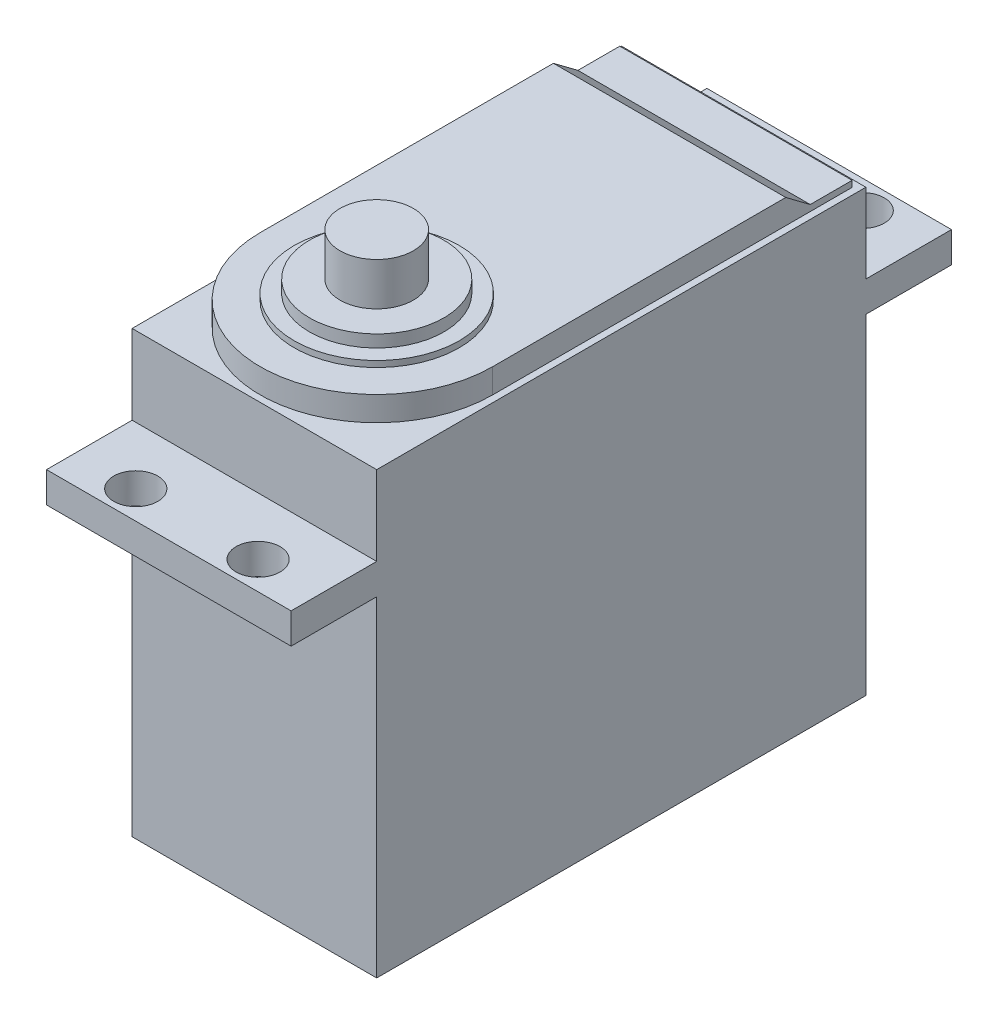
ISO-10303-21;
HEADER;
FILE_DESCRIPTION(('STEP AP214'),'2;1');
FILE_NAME('part.step','',(''),(''),'','','');
FILE_SCHEMA(('AUTOMOTIVE_DESIGN { 1 0 10303 214 1 1 1 1 }'));
ENDSEC;
DATA;
#1=APPLICATION_CONTEXT('core data for automotive mechanical design processes');
#2=APPLICATION_PROTOCOL_DEFINITION('international standard','automotive_design',2000,#1);
#3=PRODUCT_CONTEXT('',#1,'mechanical');
#4=PRODUCT('Part','Part','',(#3));
#5=PRODUCT_RELATED_PRODUCT_CATEGORY('part','',(#4));
#6=PRODUCT_DEFINITION_FORMATION('','',#4);
#7=PRODUCT_DEFINITION_CONTEXT('part definition',#1,'design');
#8=PRODUCT_DEFINITION('design','',#6,#7);
#9=PRODUCT_DEFINITION_SHAPE('','',#8);
#10=(LENGTH_UNIT() NAMED_UNIT(*) SI_UNIT(.MILLI.,.METRE.));
#11=(NAMED_UNIT(*) PLANE_ANGLE_UNIT() SI_UNIT($,.RADIAN.));
#12=(NAMED_UNIT(*) SI_UNIT($,.STERADIAN.) SOLID_ANGLE_UNIT());
#13=UNCERTAINTY_MEASURE_WITH_UNIT(LENGTH_MEASURE(1.E-05),#10,'distance_accuracy_value','');
#14=(GEOMETRIC_REPRESENTATION_CONTEXT(3) GLOBAL_UNCERTAINTY_ASSIGNED_CONTEXT((#13)) GLOBAL_UNIT_ASSIGNED_CONTEXT((#10,
#11,#12)) REPRESENTATION_CONTEXT('',''));
#15=CARTESIAN_POINT('',(0.,0.,0.));
#16=DIRECTION('',(0.,0.,1.));
#17=DIRECTION('',(1.,0.,0.));
#18=AXIS2_PLACEMENT_3D('',#15,#16,#17);
#19=CARTESIAN_POINT('',(0.,0.,40.));
#20=DIRECTION('',(0.,0.,-1.));
#21=DIRECTION('',(-1.,0.,0.));
#22=AXIS2_PLACEMENT_3D('',#19,#20,#21);
#23=PLANE('',#22);
#24=DIRECTION('',(0.,1.,0.));
#25=VECTOR('',#24,1.);
#26=CARTESIAN_POINT('',(20.,0.,40.));
#27=LINE('',#26,#25);
#28=CARTESIAN_POINT('',(20.,29.5,40.));
#29=VERTEX_POINT('',#28);
#30=CARTESIAN_POINT('',(20.,36.,40.));
#31=VERTEX_POINT('',#30);
#32=EDGE_CURVE('E296',#29,#31,#27,.T.);
#33=ORIENTED_EDGE('',*,*,#32,.T.);
#34=DIRECTION('',(1.,0.,0.));
#35=VECTOR('',#34,1.);
#36=CARTESIAN_POINT('',(20.,36.,40.));
#37=LINE('',#36,#35);
#38=CARTESIAN_POINT('',(0.,36.,40.));
#39=VERTEX_POINT('',#38);
#40=EDGE_CURVE('E53',#39,#31,#37,.T.);
#41=ORIENTED_EDGE('',*,*,#40,.F.);
#42=DIRECTION('',(0.,-1.,0.));
#43=VECTOR('',#42,1.);
#44=CARTESIAN_POINT('',(0.,0.,40.));
#45=LINE('',#44,#43);
#46=CARTESIAN_POINT('',(0.,29.5,40.));
#47=VERTEX_POINT('',#46);
#48=EDGE_CURVE('E291',#39,#47,#45,.T.);
#49=ORIENTED_EDGE('',*,*,#48,.T.);
#50=DIRECTION('',(-1.,0.,0.));
#51=VECTOR('',#50,1.);
#52=CARTESIAN_POINT('',(27.4330343736593,29.5,40.));
#53=LINE('',#52,#51);
#54=EDGE_CURVE('E243',#29,#47,#53,.T.);
#55=ORIENTED_EDGE('',*,*,#54,.F.);
#56=EDGE_LOOP('',(#33,#41,#49,#55));
#57=FACE_BOUND('',#56,.T.);
#58=ADVANCED_FACE('F38',(#57),#23,.F.);
#59=CARTESIAN_POINT('',(0.,0.,0.));
#60=DIRECTION('',(0.,0.,-1.));
#61=DIRECTION('',(-1.,0.,0.));
#62=AXIS2_PLACEMENT_3D('',#59,#60,#61);
#63=PLANE('',#62);
#64=DIRECTION('',(-1.,0.,0.));
#65=VECTOR('',#64,1.);
#66=CARTESIAN_POINT('',(0.,36.,0.));
#67=LINE('',#66,#65);
#68=CARTESIAN_POINT('',(20.,36.,0.));
#69=VERTEX_POINT('',#68);
#70=CARTESIAN_POINT('',(0.,36.,0.));
#71=VERTEX_POINT('',#70);
#72=EDGE_CURVE('E208',#69,#71,#67,.T.);
#73=ORIENTED_EDGE('',*,*,#72,.F.);
#74=DIRECTION('',(0.,1.,0.));
#75=VECTOR('',#74,1.);
#76=CARTESIAN_POINT('',(20.,0.,0.));
#77=LINE('',#76,#75);
#78=CARTESIAN_POINT('',(20.,29.5,0.));
#79=VERTEX_POINT('',#78);
#80=EDGE_CURVE('E304',#79,#69,#77,.T.);
#81=ORIENTED_EDGE('',*,*,#80,.F.);
#82=DIRECTION('',(-1.,0.,0.));
#83=VECTOR('',#82,1.);
#84=CARTESIAN_POINT('',(27.4330343736593,29.5,0.));
#85=LINE('',#84,#83);
#86=CARTESIAN_POINT('',(0.,29.5,0.));
#87=VERTEX_POINT('',#86);
#88=EDGE_CURVE('E279',#79,#87,#85,.T.);
#89=ORIENTED_EDGE('',*,*,#88,.T.);
#90=DIRECTION('',(0.,-1.,0.));
#91=VECTOR('',#90,1.);
#92=CARTESIAN_POINT('',(0.,0.,0.));
#93=LINE('',#92,#91);
#94=EDGE_CURVE('E300',#71,#87,#93,.T.);
#95=ORIENTED_EDGE('',*,*,#94,.F.);
#96=EDGE_LOOP('',(#73,#81,#89,#95));
#97=FACE_BOUND('',#96,.T.);
#98=ADVANCED_FACE('F349',(#97),#63,.T.);
#99=CARTESIAN_POINT('',(0.,0.,40.));
#100=DIRECTION('',(1.,0.,0.));
#101=DIRECTION('',(0.,0.,-1.));
#102=AXIS2_PLACEMENT_3D('',#99,#100,#101);
#103=PLANE('',#102);
#104=ORIENTED_EDGE('',*,*,#48,.F.);
#105=DIRECTION('',(0.,0.,1.));
#106=VECTOR('',#105,1.);
#107=CARTESIAN_POINT('',(0.,36.,40.));
#108=LINE('',#107,#106);
#109=EDGE_CURVE('E210',#71,#39,#108,.T.);
#110=ORIENTED_EDGE('',*,*,#109,.F.);
#111=ORIENTED_EDGE('',*,*,#94,.T.);
#112=DIRECTION('',(0.,0.,-1.));
#113=VECTOR('',#112,1.);
#114=CARTESIAN_POINT('',(0.,29.5,0.));
#115=LINE('',#114,#113);
#116=CARTESIAN_POINT('',(0.,29.5,-7.));
#117=VERTEX_POINT('',#116);
#118=EDGE_CURVE('E264',#87,#117,#115,.T.);
#119=ORIENTED_EDGE('',*,*,#118,.T.);
#120=DIRECTION('',(0.,-1.,0.));
#121=VECTOR('',#120,1.);
#122=CARTESIAN_POINT('',(0.,29.5,-7.));
#123=LINE('',#122,#121);
#124=CARTESIAN_POINT('',(0.,27.,-7.));
#125=VERTEX_POINT('',#124);
#126=EDGE_CURVE('E273',#117,#125,#123,.T.);
#127=ORIENTED_EDGE('',*,*,#126,.T.);
#128=DIRECTION('',(0.,0.,1.));
#129=VECTOR('',#128,1.);
#130=CARTESIAN_POINT('',(0.,27.,0.));
#131=LINE('',#130,#129);
#132=CARTESIAN_POINT('',(0.,27.,0.));
#133=VERTEX_POINT('',#132);
#134=EDGE_CURVE('E276',#125,#133,#131,.T.);
#135=ORIENTED_EDGE('',*,*,#134,.T.);
#136=CARTESIAN_POINT('',(0.,0.,0.));
#137=VERTEX_POINT('',#136);
#138=EDGE_CURVE('E290',#133,#137,#93,.T.);
#139=ORIENTED_EDGE('',*,*,#138,.T.);
#140=DIRECTION('',(0.,0.,-1.));
#141=VECTOR('',#140,1.);
#142=CARTESIAN_POINT('',(0.,0.,40.));
#143=LINE('',#142,#141);
#144=CARTESIAN_POINT('',(0.,0.,40.));
#145=VERTEX_POINT('',#144);
#146=EDGE_CURVE('E310',#145,#137,#143,.T.);
#147=ORIENTED_EDGE('',*,*,#146,.F.);
#148=CARTESIAN_POINT('',(0.,27.,40.));
#149=VERTEX_POINT('',#148);
#150=EDGE_CURVE('E294',#149,#145,#45,.T.);
#151=ORIENTED_EDGE('',*,*,#150,.F.);
#152=DIRECTION('',(0.,0.,1.));
#153=VECTOR('',#152,1.);
#154=CARTESIAN_POINT('',(0.,27.,40.));
#155=LINE('',#154,#153);
#156=CARTESIAN_POINT('',(0.,27.,47.));
#157=VERTEX_POINT('',#156);
#158=EDGE_CURVE('E239',#149,#157,#155,.T.);
#159=ORIENTED_EDGE('',*,*,#158,.T.);
#160=DIRECTION('',(0.,1.,0.));
#161=VECTOR('',#160,1.);
#162=CARTESIAN_POINT('',(0.,29.5,47.));
#163=LINE('',#162,#161);
#164=CARTESIAN_POINT('',(0.,29.5,47.));
#165=VERTEX_POINT('',#164);
#166=EDGE_CURVE('E248',#157,#165,#163,.T.);
#167=ORIENTED_EDGE('',*,*,#166,.T.);
#168=DIRECTION('',(0.,0.,-1.));
#169=VECTOR('',#168,1.);
#170=CARTESIAN_POINT('',(0.,29.5,40.));
#171=LINE('',#170,#169);
#172=EDGE_CURVE('E251',#165,#47,#171,.T.);
#173=ORIENTED_EDGE('',*,*,#172,.T.);
#174=EDGE_LOOP('',(#104,#110,#111,#119,#127,#135,#139,#147,#151,#159,#167,#173));
#175=FACE_BOUND('',#174,.T.);
#176=ADVANCED_FACE('F40',(#175),#103,.F.);
#177=CARTESIAN_POINT('',(0.,0.,40.));
#178=DIRECTION('',(0.,1.,0.));
#179=DIRECTION('',(0.,0.,1.));
#180=AXIS2_PLACEMENT_3D('',#177,#178,#179);
#181=PLANE('',#180);
#182=DIRECTION('',(1.,0.,0.));
#183=VECTOR('',#182,1.);
#184=CARTESIAN_POINT('',(0.,0.,0.));
#185=LINE('',#184,#183);
#186=CARTESIAN_POINT('',(20.,0.,0.));
#187=VERTEX_POINT('',#186);
#188=EDGE_CURVE('E302',#137,#187,#185,.T.);
#189=ORIENTED_EDGE('',*,*,#188,.T.);
#190=DIRECTION('',(0.,0.,-1.));
#191=VECTOR('',#190,1.);
#192=CARTESIAN_POINT('',(20.,0.,40.));
#193=LINE('',#192,#191);
#194=CARTESIAN_POINT('',(20.,0.,40.));
#195=VERTEX_POINT('',#194);
#196=EDGE_CURVE('E299',#195,#187,#193,.T.);
#197=ORIENTED_EDGE('',*,*,#196,.F.);
#198=DIRECTION('',(1.,0.,0.));
#199=VECTOR('',#198,1.);
#200=CARTESIAN_POINT('',(0.,0.,40.));
#201=LINE('',#200,#199);
#202=EDGE_CURVE('E293',#145,#195,#201,.T.);
#203=ORIENTED_EDGE('',*,*,#202,.F.);
#204=ORIENTED_EDGE('',*,*,#146,.T.);
#205=EDGE_LOOP('',(#189,#197,#203,#204));
#206=FACE_BOUND('',#205,.T.);
#207=ADVANCED_FACE('F370',(#206),#181,.F.);
#208=CARTESIAN_POINT('',(20.,0.,40.));
#209=DIRECTION('',(-1.,0.,0.));
#210=DIRECTION('',(0.,0.,1.));
#211=AXIS2_PLACEMENT_3D('',#208,#209,#210);
#212=PLANE('',#211);
#213=ORIENTED_EDGE('',*,*,#80,.T.);
#214=DIRECTION('',(0.,0.,-1.));
#215=VECTOR('',#214,1.);
#216=CARTESIAN_POINT('',(20.,36.,0.));
#217=LINE('',#216,#215);
#218=EDGE_CURVE('E202',#31,#69,#217,.T.);
#219=ORIENTED_EDGE('',*,*,#218,.F.);
#220=ORIENTED_EDGE('',*,*,#32,.F.);
#221=DIRECTION('',(0.,0.,1.));
#222=VECTOR('',#221,1.);
#223=CARTESIAN_POINT('',(20.,29.5,40.));
#224=LINE('',#223,#222);
#225=CARTESIAN_POINT('',(20.,29.5,47.));
#226=VERTEX_POINT('',#225);
#227=EDGE_CURVE('E242',#29,#226,#224,.T.);
#228=ORIENTED_EDGE('',*,*,#227,.T.);
#229=DIRECTION('',(0.,-1.,0.));
#230=VECTOR('',#229,1.);
#231=CARTESIAN_POINT('',(20.,29.5,47.));
#232=LINE('',#231,#230);
#233=CARTESIAN_POINT('',(20.,27.,47.));
#234=VERTEX_POINT('',#233);
#235=EDGE_CURVE('E240',#226,#234,#232,.T.);
#236=ORIENTED_EDGE('',*,*,#235,.T.);
#237=DIRECTION('',(0.,0.,-1.));
#238=VECTOR('',#237,1.);
#239=CARTESIAN_POINT('',(20.,27.,40.));
#240=LINE('',#239,#238);
#241=CARTESIAN_POINT('',(20.,27.,40.));
#242=VERTEX_POINT('',#241);
#243=EDGE_CURVE('E245',#234,#242,#240,.T.);
#244=ORIENTED_EDGE('',*,*,#243,.T.);
#245=EDGE_CURVE('E297',#195,#242,#27,.T.);
#246=ORIENTED_EDGE('',*,*,#245,.F.);
#247=ORIENTED_EDGE('',*,*,#196,.T.);
#248=CARTESIAN_POINT('',(20.,27.,0.));
#249=VERTEX_POINT('',#248);
#250=EDGE_CURVE('E305',#187,#249,#77,.T.);
#251=ORIENTED_EDGE('',*,*,#250,.T.);
#252=DIRECTION('',(0.,0.,-1.));
#253=VECTOR('',#252,1.);
#254=CARTESIAN_POINT('',(20.,27.,0.));
#255=LINE('',#254,#253);
#256=CARTESIAN_POINT('',(20.,27.,-7.));
#257=VERTEX_POINT('',#256);
#258=EDGE_CURVE('E267',#249,#257,#255,.T.);
#259=ORIENTED_EDGE('',*,*,#258,.T.);
#260=DIRECTION('',(0.,1.,0.));
#261=VECTOR('',#260,1.);
#262=CARTESIAN_POINT('',(20.,29.5,-7.));
#263=LINE('',#262,#261);
#264=CARTESIAN_POINT('',(20.,29.5,-7.));
#265=VERTEX_POINT('',#264);
#266=EDGE_CURVE('E265',#257,#265,#263,.T.);
#267=ORIENTED_EDGE('',*,*,#266,.T.);
#268=DIRECTION('',(0.,0.,1.));
#269=VECTOR('',#268,1.);
#270=CARTESIAN_POINT('',(20.,29.5,0.));
#271=LINE('',#270,#269);
#272=EDGE_CURVE('E270',#265,#79,#271,.T.);
#273=ORIENTED_EDGE('',*,*,#272,.T.);
#274=EDGE_LOOP('',(#213,#219,#220,#228,#236,#244,#246,#247,#251,#259,#267,#273));
#275=FACE_BOUND('',#274,.T.);
#276=ADVANCED_FACE('F362',(#275),#212,.F.);
#277=ORIENTED_EDGE('',*,*,#245,.T.);
#278=DIRECTION('',(-1.,0.,0.));
#279=VECTOR('',#278,1.);
#280=CARTESIAN_POINT('',(27.4330343736593,27.,40.));
#281=LINE('',#280,#279);
#282=EDGE_CURVE('E254',#242,#149,#281,.T.);
#283=ORIENTED_EDGE('',*,*,#282,.T.);
#284=ORIENTED_EDGE('',*,*,#150,.T.);
#285=ORIENTED_EDGE('',*,*,#202,.T.);
#286=EDGE_LOOP('',(#277,#283,#284,#285));
#287=FACE_BOUND('',#286,.T.);
#288=ADVANCED_FACE('F352',(#287),#23,.F.);
#289=DIRECTION('',(-1.,0.,0.));
#290=VECTOR('',#289,1.);
#291=CARTESIAN_POINT('',(27.4330343736593,27.,0.));
#292=LINE('',#291,#290);
#293=EDGE_CURVE('E268',#249,#133,#292,.T.);
#294=ORIENTED_EDGE('',*,*,#293,.F.);
#295=ORIENTED_EDGE('',*,*,#250,.F.);
#296=ORIENTED_EDGE('',*,*,#188,.F.);
#297=ORIENTED_EDGE('',*,*,#138,.F.);
#298=EDGE_LOOP('',(#294,#295,#296,#297));
#299=FACE_BOUND('',#298,.T.);
#300=ADVANCED_FACE('F358',(#299),#63,.T.);
#301=CARTESIAN_POINT('',(27.4330343736593,27.,0.));
#302=DIRECTION('',(0.,-1.,0.));
#303=DIRECTION('',(0.,0.,-1.));
#304=AXIS2_PLACEMENT_3D('',#301,#302,#303);
#305=PLANE('',#304);
#306=CARTESIAN_POINT('',(15.,27.,-4.7));
#307=DIRECTION('',(0.,-1.,0.));
#308=DIRECTION('',(0.,0.,-1.));
#309=AXIS2_PLACEMENT_3D('',#306,#307,#308);
#310=CIRCLE('',#309,1.80000000000001);
#311=CARTESIAN_POINT('',(15.,27.,-6.50000000000001));
#312=VERTEX_POINT('',#311);
#313=EDGE_CURVE('E232',#312,#312,#310,.T.);
#314=ORIENTED_EDGE('',*,*,#313,.F.);
#315=EDGE_LOOP('',(#314));
#316=FACE_BOUND('',#315,.T.);
#317=CARTESIAN_POINT('',(5.,27.,-4.7));
#318=DIRECTION('',(0.,-1.,0.));
#319=DIRECTION('',(0.,0.,-1.));
#320=AXIS2_PLACEMENT_3D('',#317,#318,#319);
#321=CIRCLE('',#320,1.80000000000001);
#322=CARTESIAN_POINT('',(5.,27.,-6.50000000000001));
#323=VERTEX_POINT('',#322);
#324=EDGE_CURVE('E229',#323,#323,#321,.T.);
#325=ORIENTED_EDGE('',*,*,#324,.F.);
#326=EDGE_LOOP('',(#325));
#327=FACE_BOUND('',#326,.T.);
#328=ORIENTED_EDGE('',*,*,#258,.F.);
#329=ORIENTED_EDGE('',*,*,#293,.T.);
#330=ORIENTED_EDGE('',*,*,#134,.F.);
#331=DIRECTION('',(-1.,0.,0.));
#332=VECTOR('',#331,1.);
#333=CARTESIAN_POINT('',(27.4330343736593,27.,-7.));
#334=LINE('',#333,#332);
#335=EDGE_CURVE('E282',#257,#125,#334,.T.);
#336=ORIENTED_EDGE('',*,*,#335,.F.);
#337=EDGE_LOOP('',(#328,#329,#330,#336));
#338=FACE_BOUND('',#337,.T.);
#339=ADVANCED_FACE('F368',(#316,#327,#338),#305,.T.);
#340=CARTESIAN_POINT('',(27.4330343736593,29.5,-7.));
#341=DIRECTION('',(0.,0.,-1.));
#342=DIRECTION('',(-1.,0.,0.));
#343=AXIS2_PLACEMENT_3D('',#340,#341,#342);
#344=PLANE('',#343);
#345=ORIENTED_EDGE('',*,*,#266,.F.);
#346=ORIENTED_EDGE('',*,*,#335,.T.);
#347=ORIENTED_EDGE('',*,*,#126,.F.);
#348=DIRECTION('',(-1.,0.,0.));
#349=VECTOR('',#348,1.);
#350=CARTESIAN_POINT('',(27.4330343736593,29.5,-7.));
#351=LINE('',#350,#349);
#352=EDGE_CURVE('E284',#265,#117,#351,.T.);
#353=ORIENTED_EDGE('',*,*,#352,.F.);
#354=EDGE_LOOP('',(#345,#346,#347,#353));
#355=FACE_BOUND('',#354,.T.);
#356=ADVANCED_FACE('F402',(#355),#344,.T.);
#357=CARTESIAN_POINT('',(27.4330343736593,29.5,0.));
#358=DIRECTION('',(0.,1.,0.));
#359=DIRECTION('',(0.,0.,1.));
#360=AXIS2_PLACEMENT_3D('',#357,#358,#359);
#361=PLANE('',#360);
#362=CARTESIAN_POINT('',(15.,29.5,-4.7));
#363=DIRECTION('',(0.,1.,0.));
#364=DIRECTION('',(0.,0.,1.));
#365=AXIS2_PLACEMENT_3D('',#362,#363,#364);
#366=CIRCLE('',#365,1.80000000000001);
#367=CARTESIAN_POINT('',(15.,29.5,-2.89999999999999));
#368=VERTEX_POINT('',#367);
#369=EDGE_CURVE('E219',#368,#368,#366,.T.);
#370=ORIENTED_EDGE('',*,*,#369,.F.);
#371=EDGE_LOOP('',(#370));
#372=FACE_BOUND('',#371,.T.);
#373=CARTESIAN_POINT('',(5.,29.5,-4.7));
#374=DIRECTION('',(0.,1.,0.));
#375=DIRECTION('',(0.,0.,1.));
#376=AXIS2_PLACEMENT_3D('',#373,#374,#375);
#377=CIRCLE('',#376,1.80000000000001);
#378=CARTESIAN_POINT('',(5.,29.5,-2.89999999999999));
#379=VERTEX_POINT('',#378);
#380=EDGE_CURVE('E216',#379,#379,#377,.T.);
#381=ORIENTED_EDGE('',*,*,#380,.F.);
#382=EDGE_LOOP('',(#381));
#383=FACE_BOUND('',#382,.T.);
#384=ORIENTED_EDGE('',*,*,#272,.F.);
#385=ORIENTED_EDGE('',*,*,#352,.T.);
#386=ORIENTED_EDGE('',*,*,#118,.F.);
#387=ORIENTED_EDGE('',*,*,#88,.F.);
#388=EDGE_LOOP('',(#384,#385,#386,#387));
#389=FACE_BOUND('',#388,.T.);
#390=ADVANCED_FACE('F406',(#372,#383,#389),#361,.T.);
#391=CARTESIAN_POINT('',(27.4330343736593,29.5,40.));
#392=DIRECTION('',(0.,1.,0.));
#393=DIRECTION('',(0.,0.,1.));
#394=AXIS2_PLACEMENT_3D('',#391,#392,#393);
#395=PLANE('',#394);
#396=CARTESIAN_POINT('',(5.,29.5,44.7));
#397=DIRECTION('',(0.,1.,0.));
#398=DIRECTION('',(0.,0.,1.));
#399=AXIS2_PLACEMENT_3D('',#396,#397,#398);
#400=CIRCLE('',#399,1.80000000000001);
#401=CARTESIAN_POINT('',(5.,29.5,46.5));
#402=VERTEX_POINT('',#401);
#403=EDGE_CURVE('E220',#402,#402,#400,.T.);
#404=ORIENTED_EDGE('',*,*,#403,.F.);
#405=EDGE_LOOP('',(#404));
#406=FACE_BOUND('',#405,.T.);
#407=CARTESIAN_POINT('',(15.,29.5,44.7));
#408=DIRECTION('',(0.,1.,0.));
#409=DIRECTION('',(0.,0.,1.));
#410=AXIS2_PLACEMENT_3D('',#407,#408,#409);
#411=CIRCLE('',#410,1.80000000000001);
#412=CARTESIAN_POINT('',(15.,29.5,46.5));
#413=VERTEX_POINT('',#412);
#414=EDGE_CURVE('E223',#413,#413,#411,.T.);
#415=ORIENTED_EDGE('',*,*,#414,.F.);
#416=EDGE_LOOP('',(#415));
#417=FACE_BOUND('',#416,.T.);
#418=ORIENTED_EDGE('',*,*,#227,.F.);
#419=ORIENTED_EDGE('',*,*,#54,.T.);
#420=ORIENTED_EDGE('',*,*,#172,.F.);
#421=DIRECTION('',(-1.,0.,0.));
#422=VECTOR('',#421,1.);
#423=CARTESIAN_POINT('',(27.4330343736593,29.5,47.));
#424=LINE('',#423,#422);
#425=EDGE_CURVE('E257',#226,#165,#424,.T.);
#426=ORIENTED_EDGE('',*,*,#425,.F.);
#427=EDGE_LOOP('',(#418,#419,#420,#426));
#428=FACE_BOUND('',#427,.T.);
#429=ADVANCED_FACE('F413',(#406,#417,#428),#395,.T.);
#430=CARTESIAN_POINT('',(27.4330343736593,29.5,47.));
#431=DIRECTION('',(0.,0.,1.));
#432=DIRECTION('',(1.,0.,0.));
#433=AXIS2_PLACEMENT_3D('',#430,#431,#432);
#434=PLANE('',#433);
#435=ORIENTED_EDGE('',*,*,#235,.F.);
#436=ORIENTED_EDGE('',*,*,#425,.T.);
#437=ORIENTED_EDGE('',*,*,#166,.F.);
#438=DIRECTION('',(-1.,0.,0.));
#439=VECTOR('',#438,1.);
#440=CARTESIAN_POINT('',(27.4330343736593,27.,47.));
#441=LINE('',#440,#439);
#442=EDGE_CURVE('E259',#234,#157,#441,.T.);
#443=ORIENTED_EDGE('',*,*,#442,.F.);
#444=EDGE_LOOP('',(#435,#436,#437,#443));
#445=FACE_BOUND('',#444,.T.);
#446=ADVANCED_FACE('F416',(#445),#434,.T.);
#447=CARTESIAN_POINT('',(27.4330343736593,27.,40.));
#448=DIRECTION('',(0.,-1.,0.));
#449=DIRECTION('',(0.,0.,-1.));
#450=AXIS2_PLACEMENT_3D('',#447,#448,#449);
#451=PLANE('',#450);
#452=CARTESIAN_POINT('',(5.,27.,44.7));
#453=DIRECTION('',(0.,-1.,0.));
#454=DIRECTION('',(0.,0.,-1.));
#455=AXIS2_PLACEMENT_3D('',#452,#453,#454);
#456=CIRCLE('',#455,1.80000000000001);
#457=CARTESIAN_POINT('',(5.,27.,42.9));
#458=VERTEX_POINT('',#457);
#459=EDGE_CURVE('E233',#458,#458,#456,.T.);
#460=ORIENTED_EDGE('',*,*,#459,.F.);
#461=EDGE_LOOP('',(#460));
#462=FACE_BOUND('',#461,.T.);
#463=CARTESIAN_POINT('',(15.,27.,44.7));
#464=DIRECTION('',(0.,-1.,0.));
#465=DIRECTION('',(0.,0.,-1.));
#466=AXIS2_PLACEMENT_3D('',#463,#464,#465);
#467=CIRCLE('',#466,1.80000000000001);
#468=CARTESIAN_POINT('',(15.,27.,42.9));
#469=VERTEX_POINT('',#468);
#470=EDGE_CURVE('E228',#469,#469,#467,.T.);
#471=ORIENTED_EDGE('',*,*,#470,.F.);
#472=EDGE_LOOP('',(#471));
#473=FACE_BOUND('',#472,.T.);
#474=ORIENTED_EDGE('',*,*,#243,.F.);
#475=ORIENTED_EDGE('',*,*,#442,.T.);
#476=ORIENTED_EDGE('',*,*,#158,.F.);
#477=ORIENTED_EDGE('',*,*,#282,.F.);
#478=EDGE_LOOP('',(#474,#475,#476,#477));
#479=FACE_BOUND('',#478,.T.);
#480=ADVANCED_FACE('F384',(#462,#473,#479),#451,.T.);
#481=CARTESIAN_POINT('',(15.,19.5,44.7));
#482=DIRECTION('',(0.,1.,0.));
#483=DIRECTION('',(0.,0.,1.));
#484=AXIS2_PLACEMENT_3D('',#481,#482,#483);
#485=CYLINDRICAL_SURFACE('',#484,1.80000000000001);
#486=ORIENTED_EDGE('',*,*,#470,.T.);
#487=EDGE_LOOP('',(#486));
#488=FACE_BOUND('',#487,.T.);
#489=ORIENTED_EDGE('',*,*,#414,.T.);
#490=EDGE_LOOP('',(#489));
#491=FACE_BOUND('',#490,.T.);
#492=ADVANCED_FACE('F423',(#488,#491),#485,.F.);
#493=CARTESIAN_POINT('',(5.,19.5,44.7));
#494=DIRECTION('',(0.,1.,0.));
#495=DIRECTION('',(0.,0.,1.));
#496=AXIS2_PLACEMENT_3D('',#493,#494,#495);
#497=CYLINDRICAL_SURFACE('',#496,1.80000000000001);
#498=ORIENTED_EDGE('',*,*,#459,.T.);
#499=EDGE_LOOP('',(#498));
#500=FACE_BOUND('',#499,.T.);
#501=ORIENTED_EDGE('',*,*,#403,.T.);
#502=EDGE_LOOP('',(#501));
#503=FACE_BOUND('',#502,.T.);
#504=ADVANCED_FACE('F444',(#500,#503),#497,.F.);
#505=CARTESIAN_POINT('',(5.,19.5,-4.7));
#506=DIRECTION('',(0.,1.,0.));
#507=DIRECTION('',(0.,0.,1.));
#508=AXIS2_PLACEMENT_3D('',#505,#506,#507);
#509=CYLINDRICAL_SURFACE('',#508,1.80000000000001);
#510=ORIENTED_EDGE('',*,*,#324,.T.);
#511=EDGE_LOOP('',(#510));
#512=FACE_BOUND('',#511,.T.);
#513=ORIENTED_EDGE('',*,*,#380,.T.);
#514=EDGE_LOOP('',(#513));
#515=FACE_BOUND('',#514,.T.);
#516=ADVANCED_FACE('F442',(#512,#515),#509,.F.);
#517=CARTESIAN_POINT('',(15.,19.5,-4.7));
#518=DIRECTION('',(0.,1.,0.));
#519=DIRECTION('',(0.,0.,1.));
#520=AXIS2_PLACEMENT_3D('',#517,#518,#519);
#521=CYLINDRICAL_SURFACE('',#520,1.80000000000001);
#522=ORIENTED_EDGE('',*,*,#313,.T.);
#523=EDGE_LOOP('',(#522));
#524=FACE_BOUND('',#523,.T.);
#525=ORIENTED_EDGE('',*,*,#369,.T.);
#526=EDGE_LOOP('',(#525));
#527=FACE_BOUND('',#526,.T.);
#528=ADVANCED_FACE('F345',(#524,#527),#521,.F.);
#529=CARTESIAN_POINT('',(0.449743202817203,36.,0.575747888871118));
#530=DIRECTION('',(0.,0.,-1.));
#531=DIRECTION('',(-1.,0.,0.));
#532=AXIS2_PLACEMENT_3D('',#529,#530,#531);
#533=PLANE('',#532);
#534=DIRECTION('',(1.,0.,0.));
#535=VECTOR('',#534,1.);
#536=CARTESIAN_POINT('',(40.,36.5,0.575747888871118));
#537=LINE('',#536,#535);
#538=CARTESIAN_POINT('',(0.449743202817203,36.5,0.575747888871118));
#539=VERTEX_POINT('',#538);
#540=CARTESIAN_POINT('',(19.4497432028172,36.5,0.575747888871118));
#541=VERTEX_POINT('',#540);
#542=EDGE_CURVE('E46',#539,#541,#537,.T.);
#543=ORIENTED_EDGE('',*,*,#542,.T.);
#544=DIRECTION('',(0.,1.,0.));
#545=VECTOR('',#544,1.);
#546=CARTESIAN_POINT('',(19.4497432028172,36.,0.575747888871118));
#547=LINE('',#546,#545);
#548=CARTESIAN_POINT('',(19.4497432028172,36.,0.575747888871118));
#549=VERTEX_POINT('',#548);
#550=EDGE_CURVE('E173',#549,#541,#547,.T.);
#551=ORIENTED_EDGE('',*,*,#550,.F.);
#552=DIRECTION('',(-1.,0.,0.));
#553=VECTOR('',#552,1.);
#554=CARTESIAN_POINT('',(0.449743202817203,36.,0.575747888871118));
#555=LINE('',#554,#553);
#556=CARTESIAN_POINT('',(0.449743202817203,36.,0.575747888871118));
#557=VERTEX_POINT('',#556);
#558=EDGE_CURVE('E183',#549,#557,#555,.T.);
#559=ORIENTED_EDGE('',*,*,#558,.T.);
#560=DIRECTION('',(0.,1.,0.));
#561=VECTOR('',#560,1.);
#562=CARTESIAN_POINT('',(0.449743202817203,36.,0.575747888871118));
#563=LINE('',#562,#561);
#564=EDGE_CURVE('E203',#557,#539,#563,.T.);
#565=ORIENTED_EDGE('',*,*,#564,.T.);
#566=EDGE_LOOP('',(#543,#551,#559,#565));
#567=FACE_BOUND('',#566,.T.);
#568=ADVANCED_FACE('F325',(#567),#533,.T.);
#569=CARTESIAN_POINT('',(0.449743202817203,36.,29.9759742407741));
#570=DIRECTION('',(-1.,0.,0.));
#571=DIRECTION('',(0.,0.,1.));
#572=AXIS2_PLACEMENT_3D('',#569,#570,#571);
#573=PLANE('',#572);
#574=DIRECTION('',(0.,0.,-1.));
#575=VECTOR('',#574,1.);
#576=CARTESIAN_POINT('',(0.449743202817203,36.5,4.));
#577=LINE('',#576,#575);
#578=CARTESIAN_POINT('',(0.449743202817203,36.5,4.));
#579=VERTEX_POINT('',#578);
#580=EDGE_CURVE('E214',#579,#539,#577,.T.);
#581=ORIENTED_EDGE('',*,*,#580,.T.);
#582=ORIENTED_EDGE('',*,*,#564,.F.);
#583=DIRECTION('',(0.,0.,1.));
#584=VECTOR('',#583,1.);
#585=CARTESIAN_POINT('',(0.449743202817203,36.,29.9759742407741));
#586=LINE('',#585,#584);
#587=CARTESIAN_POINT('',(0.449743202817203,36.,29.9759742407741));
#588=VERTEX_POINT('',#587);
#589=EDGE_CURVE('E174',#557,#588,#586,.T.);
#590=ORIENTED_EDGE('',*,*,#589,.T.);
#591=DIRECTION('',(0.,1.,0.));
#592=VECTOR('',#591,1.);
#593=CARTESIAN_POINT('',(0.449743202817203,36.,29.9759742407741));
#594=LINE('',#593,#592);
#595=CARTESIAN_POINT('',(0.449743202817203,38.,29.9759742407741));
#596=VERTEX_POINT('',#595);
#597=EDGE_CURVE('E187',#588,#596,#594,.T.);
#598=ORIENTED_EDGE('',*,*,#597,.T.);
#599=DIRECTION('',(0.,0.,1.));
#600=VECTOR('',#599,1.);
#601=CARTESIAN_POINT('',(0.449743202817203,38.,29.9759742407741));
#602=LINE('',#601,#600);
#603=CARTESIAN_POINT('',(0.449743202817203,38.,5.99999999999999));
#604=VERTEX_POINT('',#603);
#605=EDGE_CURVE('E188',#604,#596,#602,.T.);
#606=ORIENTED_EDGE('',*,*,#605,.F.);
#607=DIRECTION('',(0.,-0.6,-0.8));
#608=VECTOR('',#607,1.);
#609=CARTESIAN_POINT('',(0.449743202817203,38.,6.));
#610=LINE('',#609,#608);
#611=EDGE_CURVE('E322',#604,#579,#610,.T.);
#612=ORIENTED_EDGE('',*,*,#611,.T.);
#613=EDGE_LOOP('',(#581,#582,#590,#598,#606,#612));
#614=FACE_BOUND('',#613,.T.);
#615=ADVANCED_FACE('F337',(#614),#573,.T.);
#616=CARTESIAN_POINT('',(19.4497432028172,36.,29.9759742407741));
#617=DIRECTION('',(1.,0.,0.));
#618=DIRECTION('',(0.,0.,-1.));
#619=AXIS2_PLACEMENT_3D('',#616,#617,#618);
#620=PLANE('',#619);
#621=DIRECTION('',(0.,0.,1.));
#622=VECTOR('',#621,1.);
#623=CARTESIAN_POINT('',(19.4497432028172,36.5,4.));
#624=LINE('',#623,#622);
#625=CARTESIAN_POINT('',(19.4497432028172,36.5,4.));
#626=VERTEX_POINT('',#625);
#627=EDGE_CURVE('E61',#541,#626,#624,.T.);
#628=ORIENTED_EDGE('',*,*,#627,.T.);
#629=DIRECTION('',(0.,0.6,0.8));
#630=VECTOR('',#629,1.);
#631=CARTESIAN_POINT('',(19.4497432028172,38.,6.));
#632=LINE('',#631,#630);
#633=CARTESIAN_POINT('',(19.4497432028172,38.,5.99999999999999));
#634=VERTEX_POINT('',#633);
#635=EDGE_CURVE('E316',#626,#634,#632,.T.);
#636=ORIENTED_EDGE('',*,*,#635,.T.);
#637=DIRECTION('',(0.,0.,-1.));
#638=VECTOR('',#637,1.);
#639=CARTESIAN_POINT('',(19.4497432028172,38.,29.9759742407741));
#640=LINE('',#639,#638);
#641=CARTESIAN_POINT('',(19.4497432028172,38.,29.9759742407741));
#642=VERTEX_POINT('',#641);
#643=EDGE_CURVE('E168',#642,#634,#640,.T.);
#644=ORIENTED_EDGE('',*,*,#643,.F.);
#645=DIRECTION('',(0.,1.,0.));
#646=VECTOR('',#645,1.);
#647=CARTESIAN_POINT('',(19.4497432028172,36.,29.9759742407741));
#648=LINE('',#647,#646);
#649=CARTESIAN_POINT('',(19.4497432028172,36.,29.9759742407741));
#650=VERTEX_POINT('',#649);
#651=EDGE_CURVE('E163',#650,#642,#648,.T.);
#652=ORIENTED_EDGE('',*,*,#651,.F.);
#653=DIRECTION('',(0.,0.,-1.));
#654=VECTOR('',#653,1.);
#655=CARTESIAN_POINT('',(19.4497432028172,36.,29.9759742407741));
#656=LINE('',#655,#654);
#657=EDGE_CURVE('E166',#650,#549,#656,.T.);
#658=ORIENTED_EDGE('',*,*,#657,.T.);
#659=ORIENTED_EDGE('',*,*,#550,.T.);
#660=EDGE_LOOP('',(#628,#636,#644,#652,#658,#659));
#661=FACE_BOUND('',#660,.T.);
#662=ADVANCED_FACE('F165',(#661),#620,.T.);
#663=CARTESIAN_POINT('',(0.,36.,0.));
#664=DIRECTION('',(0.,-1.,0.));
#665=DIRECTION('',(0.,0.,-1.));
#666=AXIS2_PLACEMENT_3D('',#663,#664,#665);
#667=PLANE('',#666);
#668=CARTESIAN_POINT('',(9.9497432028172,36.,29.9759742407741));
#669=DIRECTION('',(0.,1.,0.));
#670=DIRECTION('',(0.,0.,1.));
#671=AXIS2_PLACEMENT_3D('',#668,#669,#670);
#672=CIRCLE('',#671,9.5);
#673=EDGE_CURVE('E180',#588,#650,#672,.T.);
#674=ORIENTED_EDGE('',*,*,#673,.F.);
#675=ORIENTED_EDGE('',*,*,#589,.F.);
#676=ORIENTED_EDGE('',*,*,#558,.F.);
#677=ORIENTED_EDGE('',*,*,#657,.F.);
#678=EDGE_LOOP('',(#674,#675,#676,#677));
#679=FACE_BOUND('',#678,.T.);
#680=ORIENTED_EDGE('',*,*,#218,.T.);
#681=ORIENTED_EDGE('',*,*,#72,.T.);
#682=ORIENTED_EDGE('',*,*,#109,.T.);
#683=ORIENTED_EDGE('',*,*,#40,.T.);
#684=EDGE_LOOP('',(#680,#681,#682,#683));
#685=FACE_BOUND('',#684,.T.);
#686=ADVANCED_FACE('F178',(#679,#685),#667,.F.);
#687=CARTESIAN_POINT('',(9.9497432028172,36.,29.9759742407741));
#688=DIRECTION('',(0.,1.,0.));
#689=DIRECTION('',(0.,0.,1.));
#690=AXIS2_PLACEMENT_3D('',#687,#688,#689);
#691=CYLINDRICAL_SURFACE('',#690,9.5);
#692=CARTESIAN_POINT('',(9.9497432028172,38.,29.9759742407741));
#693=DIRECTION('',(0.,1.,0.));
#694=DIRECTION('',(0.,0.,1.));
#695=AXIS2_PLACEMENT_3D('',#692,#693,#694);
#696=CIRCLE('',#695,9.5);
#697=EDGE_CURVE('E198',#596,#642,#696,.T.);
#698=ORIENTED_EDGE('',*,*,#697,.F.);
#699=ORIENTED_EDGE('',*,*,#597,.F.);
#700=ORIENTED_EDGE('',*,*,#673,.T.);
#701=ORIENTED_EDGE('',*,*,#651,.T.);
#702=EDGE_LOOP('',(#698,#699,#700,#701));
#703=FACE_BOUND('',#702,.T.);
#704=ADVANCED_FACE('F186',(#703),#691,.T.);
#705=CARTESIAN_POINT('',(40.,38.,6.));
#706=DIRECTION('',(0.,-0.8,0.6));
#707=DIRECTION('',(0.,-0.6,-0.8));
#708=AXIS2_PLACEMENT_3D('',#705,#706,#707);
#709=PLANE('',#708);
#710=ORIENTED_EDGE('',*,*,#611,.F.);
#711=DIRECTION('',(-1.,0.,0.));
#712=VECTOR('',#711,1.);
#713=CARTESIAN_POINT('',(0.,38.,6.));
#714=LINE('',#713,#712);
#715=EDGE_CURVE('E313',#634,#604,#714,.T.);
#716=ORIENTED_EDGE('',*,*,#715,.F.);
#717=ORIENTED_EDGE('',*,*,#635,.F.);
#718=DIRECTION('',(-1.,0.,0.));
#719=VECTOR('',#718,1.);
#720=CARTESIAN_POINT('',(40.,36.5,4.));
#721=LINE('',#720,#719);
#722=EDGE_CURVE('E236',#626,#579,#721,.T.);
#723=ORIENTED_EDGE('',*,*,#722,.T.);
#724=EDGE_LOOP('',(#710,#716,#717,#723));
#725=FACE_BOUND('',#724,.T.);
#726=ADVANCED_FACE('F332',(#725),#709,.F.);
#727=CARTESIAN_POINT('',(40.,36.5,4.));
#728=DIRECTION('',(0.,-1.,0.));
#729=DIRECTION('',(0.,0.,-1.));
#730=AXIS2_PLACEMENT_3D('',#727,#728,#729);
#731=PLANE('',#730);
#732=ORIENTED_EDGE('',*,*,#580,.F.);
#733=ORIENTED_EDGE('',*,*,#722,.F.);
#734=ORIENTED_EDGE('',*,*,#627,.F.);
#735=ORIENTED_EDGE('',*,*,#542,.F.);
#736=EDGE_LOOP('',(#732,#733,#734,#735));
#737=FACE_BOUND('',#736,.T.);
#738=ADVANCED_FACE('F329',(#737),#731,.F.);
#739=CARTESIAN_POINT('',(0.,38.,40.));
#740=DIRECTION('',(0.,-1.,0.));
#741=DIRECTION('',(0.,0.,-1.));
#742=AXIS2_PLACEMENT_3D('',#739,#740,#741);
#743=PLANE('',#742);
#744=CARTESIAN_POINT('',(10.,38.,30.));
#745=DIRECTION('',(0.,-1.,0.));
#746=DIRECTION('',(0.,0.,-1.));
#747=AXIS2_PLACEMENT_3D('',#744,#745,#746);
#748=CIRCLE('',#747,6.75);
#749=CARTESIAN_POINT('',(10.,38.,23.25));
#750=VERTEX_POINT('',#749);
#751=EDGE_CURVE('E11',#750,#750,#748,.F.);
#752=ORIENTED_EDGE('',*,*,#751,.F.);
#753=EDGE_LOOP('',(#752));
#754=FACE_BOUND('',#753,.T.);
#755=ORIENTED_EDGE('',*,*,#605,.T.);
#756=ORIENTED_EDGE('',*,*,#697,.T.);
#757=ORIENTED_EDGE('',*,*,#643,.T.);
#758=ORIENTED_EDGE('',*,*,#715,.T.);
#759=EDGE_LOOP('',(#755,#756,#757,#758));
#760=FACE_BOUND('',#759,.T.);
#761=ADVANCED_FACE('F335',(#754,#760),#743,.F.);
#762=CARTESIAN_POINT('',(10.,38.5,30.));
#763=DIRECTION('',(0.,-1.,0.));
#764=DIRECTION('',(0.,0.,-1.));
#765=AXIS2_PLACEMENT_3D('',#762,#763,#764);
#766=CYLINDRICAL_SURFACE('',#765,6.75);
#767=CARTESIAN_POINT('',(10.,38.5,30.));
#768=DIRECTION('',(0.,1.,0.));
#769=DIRECTION('',(0.,0.,1.));
#770=AXIS2_PLACEMENT_3D('',#767,#768,#769);
#771=CIRCLE('',#770,6.75);
#772=CARTESIAN_POINT('',(10.,38.5,36.75));
#773=VERTEX_POINT('',#772);
#774=EDGE_CURVE('E193',#773,#773,#771,.T.);
#775=ORIENTED_EDGE('',*,*,#774,.F.);
#776=EDGE_LOOP('',(#775));
#777=FACE_BOUND('',#776,.T.);
#778=ORIENTED_EDGE('',*,*,#751,.T.);
#779=EDGE_LOOP('',(#778));
#780=FACE_BOUND('',#779,.T.);
#781=ADVANCED_FACE('F466',(#777,#780),#766,.T.);
#782=CARTESIAN_POINT('',(0.,38.5,0.));
#783=DIRECTION('',(0.,1.,0.));
#784=DIRECTION('',(0.,0.,1.));
#785=AXIS2_PLACEMENT_3D('',#782,#783,#784);
#786=PLANE('',#785);
#787=CARTESIAN_POINT('',(10.,38.5,30.));
#788=DIRECTION('',(0.,1.,0.));
#789=DIRECTION('',(0.,0.,1.));
#790=AXIS2_PLACEMENT_3D('',#787,#788,#789);
#791=CIRCLE('',#790,5.5);
#792=CARTESIAN_POINT('',(10.,38.5,35.5));
#793=VERTEX_POINT('',#792);
#794=EDGE_CURVE('E691',#793,#793,#791,.T.);
#795=ORIENTED_EDGE('',*,*,#794,.F.);
#796=EDGE_LOOP('',(#795));
#797=FACE_BOUND('',#796,.T.);
#798=ORIENTED_EDGE('',*,*,#774,.T.);
#799=EDGE_LOOP('',(#798));
#800=FACE_BOUND('',#799,.T.);
#801=ADVANCED_FACE('F472',(#797,#800),#786,.T.);
#802=CARTESIAN_POINT('',(10.,39.5,30.));
#803=DIRECTION('',(0.,-1.,0.));
#804=DIRECTION('',(0.,0.,-1.));
#805=AXIS2_PLACEMENT_3D('',#802,#803,#804);
#806=CYLINDRICAL_SURFACE('',#805,5.5);
#807=ORIENTED_EDGE('',*,*,#794,.T.);
#808=EDGE_LOOP('',(#807));
#809=FACE_BOUND('',#808,.T.);
#810=CARTESIAN_POINT('',(10.,39.5,30.));
#811=DIRECTION('',(0.,1.,0.));
#812=DIRECTION('',(0.,0.,1.));
#813=AXIS2_PLACEMENT_3D('',#810,#811,#812);
#814=CIRCLE('',#813,5.5);
#815=CARTESIAN_POINT('',(10.,39.5,35.5));
#816=VERTEX_POINT('',#815);
#817=EDGE_CURVE('E687',#816,#816,#814,.T.);
#818=ORIENTED_EDGE('',*,*,#817,.F.);
#819=EDGE_LOOP('',(#818));
#820=FACE_BOUND('',#819,.T.);
#821=ADVANCED_FACE('F636',(#809,#820),#806,.T.);
#822=CARTESIAN_POINT('',(0.,39.5,0.));
#823=DIRECTION('',(0.,1.,0.));
#824=DIRECTION('',(0.,0.,1.));
#825=AXIS2_PLACEMENT_3D('',#822,#823,#824);
#826=PLANE('',#825);
#827=CARTESIAN_POINT('',(10.,39.5,30.));
#828=DIRECTION('',(0.,1.,0.));
#829=DIRECTION('',(0.,0.,1.));
#830=AXIS2_PLACEMENT_3D('',#827,#828,#829);
#831=CIRCLE('',#830,3.);
#832=CARTESIAN_POINT('',(10.,39.5,33.));
#833=VERTEX_POINT('',#832);
#834=EDGE_CURVE('E684',#833,#833,#831,.T.);
#835=ORIENTED_EDGE('',*,*,#834,.F.);
#836=EDGE_LOOP('',(#835));
#837=FACE_BOUND('',#836,.T.);
#838=ORIENTED_EDGE('',*,*,#817,.T.);
#839=EDGE_LOOP('',(#838));
#840=FACE_BOUND('',#839,.T.);
#841=ADVANCED_FACE('F646',(#837,#840),#826,.T.);
#842=CARTESIAN_POINT('',(10.,43.,30.));
#843=DIRECTION('',(0.,-1.,0.));
#844=DIRECTION('',(0.,0.,-1.));
#845=AXIS2_PLACEMENT_3D('',#842,#843,#844);
#846=CYLINDRICAL_SURFACE('',#845,3.);
#847=ORIENTED_EDGE('',*,*,#834,.T.);
#848=EDGE_LOOP('',(#847));
#849=FACE_BOUND('',#848,.T.);
#850=CARTESIAN_POINT('',(10.,43.,30.));
#851=DIRECTION('',(0.,1.,0.));
#852=DIRECTION('',(0.,0.,1.));
#853=AXIS2_PLACEMENT_3D('',#850,#851,#852);
#854=CIRCLE('',#853,3.);
#855=CARTESIAN_POINT('',(10.,43.,33.));
#856=VERTEX_POINT('',#855);
#857=EDGE_CURVE('E682',#856,#856,#854,.T.);
#858=ORIENTED_EDGE('',*,*,#857,.F.);
#859=EDGE_LOOP('',(#858));
#860=FACE_BOUND('',#859,.T.);
#861=ADVANCED_FACE('F656',(#849,#860),#846,.T.);
#862=CARTESIAN_POINT('',(0.,43.,0.));
#863=DIRECTION('',(0.,1.,0.));
#864=DIRECTION('',(0.,0.,1.));
#865=AXIS2_PLACEMENT_3D('',#862,#863,#864);
#866=PLANE('',#865);
#867=ORIENTED_EDGE('',*,*,#857,.T.);
#868=EDGE_LOOP('',(#867));
#869=FACE_BOUND('',#868,.T.);
#870=ADVANCED_FACE('F666',(#869),#866,.T.);
#871=CLOSED_SHELL('',(#58,#98,#176,#207,#276,#288,#300,#339,#356,#390,#429,#446,#480,#492,#504,
#516,#528,#568,#615,#662,#686,#704,#726,#738,#761,#781,#801,#821,#841,#861,#870));
#872=MANIFOLD_SOLID_BREP('B2',#871);
#873=ADVANCED_BREP_SHAPE_REPRESENTATION('',(#18,#872),#14);
#874=SHAPE_DEFINITION_REPRESENTATION(#9,#873);
ENDSEC;
END-ISO-10303-21;
